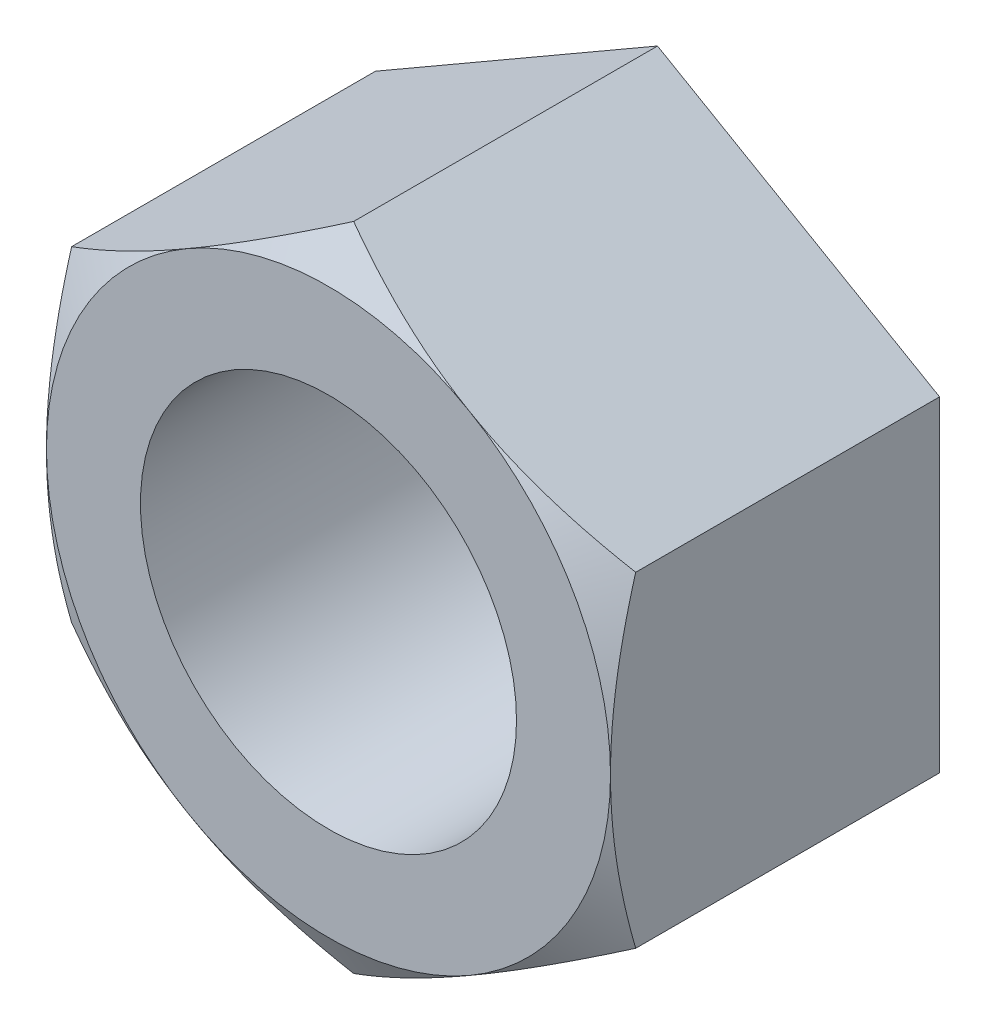
ISO-10303-21;
HEADER;
FILE_DESCRIPTION(('STEP AP214'),'2;1');
FILE_NAME('part.step','',(''),(''),'','','');
FILE_SCHEMA(('AUTOMOTIVE_DESIGN { 1 0 10303 214 1 1 1 1 }'));
ENDSEC;
DATA;
#1=APPLICATION_CONTEXT('core data for automotive mechanical design processes');
#2=APPLICATION_PROTOCOL_DEFINITION('international standard','automotive_design',2000,#1);
#3=PRODUCT_CONTEXT('',#1,'mechanical');
#4=PRODUCT('Part','Part','',(#3));
#5=PRODUCT_RELATED_PRODUCT_CATEGORY('part','',(#4));
#6=PRODUCT_DEFINITION_FORMATION('','',#4);
#7=PRODUCT_DEFINITION_CONTEXT('part definition',#1,'design');
#8=PRODUCT_DEFINITION('design','',#6,#7);
#9=PRODUCT_DEFINITION_SHAPE('','',#8);
#10=(LENGTH_UNIT() NAMED_UNIT(*) SI_UNIT(.MILLI.,.METRE.));
#11=(NAMED_UNIT(*) PLANE_ANGLE_UNIT() SI_UNIT($,.RADIAN.));
#12=(NAMED_UNIT(*) SI_UNIT($,.STERADIAN.) SOLID_ANGLE_UNIT());
#13=UNCERTAINTY_MEASURE_WITH_UNIT(LENGTH_MEASURE(1.E-05),#10,'distance_accuracy_value','');
#14=(GEOMETRIC_REPRESENTATION_CONTEXT(3) GLOBAL_UNCERTAINTY_ASSIGNED_CONTEXT((#13)) GLOBAL_UNIT_ASSIGNED_CONTEXT((#10,
#11,#12)) REPRESENTATION_CONTEXT('',''));
#15=CARTESIAN_POINT('',(0.,0.,0.));
#16=DIRECTION('',(0.,0.,1.));
#17=DIRECTION('',(1.,0.,0.));
#18=AXIS2_PLACEMENT_3D('',#15,#16,#17);
#19=CARTESIAN_POINT('',(-11.90625,6.87407664253898,6.9453125));
#20=DIRECTION('',(0.,0.,1.));
#21=DIRECTION('',(1.,0.,0.));
#22=AXIS2_PLACEMENT_3D('',#19,#20,#21);
#23=PLANE('',#22);
#24=CARTESIAN_POINT('',(0.,0.,6.9453125));
#25=DIRECTION('',(0.,0.,1.));
#26=DIRECTION('',(1.,0.,0.));
#27=AXIS2_PLACEMENT_3D('',#24,#25,#26);
#28=CIRCLE('',#27,7.9375);
#29=CARTESIAN_POINT('',(7.9375,0.,6.9453125));
#30=VERTEX_POINT('',#29);
#31=EDGE_CURVE('E258',#30,#30,#28,.T.);
#32=ORIENTED_EDGE('',*,*,#31,.F.);
#33=EDGE_LOOP('',(#32));
#34=FACE_BOUND('',#33,.T.);
#35=CARTESIAN_POINT('',(0.,0.,6.9453125));
#36=DIRECTION('',(0.,0.,1.));
#37=DIRECTION('',(1.,0.,0.));
#38=AXIS2_PLACEMENT_3D('',#35,#36,#37);
#39=CIRCLE('',#38,11.90625);
#40=CARTESIAN_POINT('',(5.95312500000001,-10.3111149638085,6.9453125));
#41=VERTEX_POINT('',#40);
#42=CARTESIAN_POINT('',(11.90625,0.,6.9453125));
#43=VERTEX_POINT('',#42);
#44=EDGE_CURVE('E146',#41,#43,#39,.T.);
#45=ORIENTED_EDGE('',*,*,#44,.T.);
#46=CARTESIAN_POINT('',(5.953125,10.3111149638085,6.9453125));
#47=VERTEX_POINT('',#46);
#48=EDGE_CURVE('E144',#43,#47,#39,.T.);
#49=ORIENTED_EDGE('',*,*,#48,.T.);
#50=CARTESIAN_POINT('',(-5.95312500000001,10.3111149638085,6.9453125));
#51=VERTEX_POINT('',#50);
#52=EDGE_CURVE('E126',#47,#51,#39,.T.);
#53=ORIENTED_EDGE('',*,*,#52,.T.);
#54=CARTESIAN_POINT('',(-11.90625,0.,6.9453125));
#55=VERTEX_POINT('',#54);
#56=EDGE_CURVE('E116',#51,#55,#39,.T.);
#57=ORIENTED_EDGE('',*,*,#56,.T.);
#58=CARTESIAN_POINT('',(-5.953125,-10.3111149638085,6.9453125));
#59=VERTEX_POINT('',#58);
#60=EDGE_CURVE('E61',#55,#59,#39,.T.);
#61=ORIENTED_EDGE('',*,*,#60,.T.);
#62=EDGE_CURVE('E69',#59,#41,#39,.T.);
#63=ORIENTED_EDGE('',*,*,#62,.T.);
#64=EDGE_LOOP('',(#45,#49,#53,#57,#61,#63));
#65=FACE_BOUND('',#64,.T.);
#66=ADVANCED_FACE('F39',(#34,#65),#23,.T.);
#67=CARTESIAN_POINT('',(0.,13.748153285078,6.9453125));
#68=DIRECTION('',(0.5,-0.866025403784438,0.));
#69=DIRECTION('',(0.866025403784438,0.5,0.));
#70=AXIS2_PLACEMENT_3D('',#67,#68,#69);
#71=PLANE('',#70);
#72=CARTESIAN_POINT('',(0.000199999999996673,13.7482687551318,5.88182247503243));
#73=CARTESIAN_POINT('',(-0.261524981873897,13.5971617663933,5.9690494750194));
#74=CARTESIAN_POINT('',(-0.524225808890103,13.4454913731991,6.05231747832444));
#75=CARTESIAN_POINT('',(-1.05173412418134,13.140934305366,6.20983699133583));
#76=CARTESIAN_POINT('',(-1.31654227499472,12.9880472482102,6.28408553553748));
#77=CARTESIAN_POINT('',(-2.11523355829519,12.5269226207973,6.49186507126941));
#78=CARTESIAN_POINT('',(-2.65226962507615,12.2168647030768,6.61004884279191));
#79=CARTESIAN_POINT('',(-3.4559194731091,11.7528772469808,6.74862990247941));
#80=CARTESIAN_POINT('',(-3.72013234184621,11.600333876092,6.78810635226597));
#81=CARTESIAN_POINT('',(-4.24978140322914,11.2945408479266,6.85430557416854));
#82=CARTESIAN_POINT('',(-4.51521761932178,11.1412911771128,6.88102810080637));
#83=CARTESIAN_POINT('',(-5.04653258377681,10.8345363393602,6.92103499348141));
#84=CARTESIAN_POINT('',(-5.31241042840957,10.6810316941899,6.93433532842185));
#85=CARTESIAN_POINT('',(-5.84441247743875,10.3738801679735,6.94721442187782));
#86=CARTESIAN_POINT('',(-6.11053667396914,10.2202332914688,6.94679360435825));
#87=CARTESIAN_POINT('',(-6.60805632941785,9.93299018446836,6.93318799784219));
#88=CARTESIAN_POINT('',(-6.83948726971147,9.79937346879103,6.92166279403806));
#89=CARTESIAN_POINT('',(-7.30181686119411,9.5324473546942,6.8884522768541));
#90=CARTESIAN_POINT('',(-7.5327154735703,9.39913797868329,6.86676624479557));
#91=CARTESIAN_POINT('',(-7.99385492656356,9.13289899136368,6.8136121488488));
#92=CARTESIAN_POINT('',(-8.22409506479845,8.99996978557551,6.78213600549017));
#93=CARTESIAN_POINT('',(-8.68349592191088,8.7347345770557,6.70995395335846));
#94=CARTESIAN_POINT('',(-8.91265656633912,8.60242861730739,6.66924741723853));
#95=CARTESIAN_POINT('',(-9.60828656873104,8.20080644817003,6.53225319705611));
#96=CARTESIAN_POINT('',(-10.0727414696073,7.93265328612266,6.42230562071017));
#97=CARTESIAN_POINT('',(-10.9947255825326,7.40034551033668,6.17276942686946));
#98=CARTESIAN_POINT('',(-11.4522665995603,7.13618408099047,6.03323941585841));
#99=CARTESIAN_POINT('',(-11.90645,6.87396117248514,5.88182247503243));
#100=B_SPLINE_CURVE_WITH_KNOTS('',3,(#72,#73,#74,#75,#76,#77,#78,#79,#80,#81,#82,#83,#84,#85,
#86,#87,#88,#89,#90,#91,#92,#93,#94,#95,#96,#97,#98,#99),.UNSPECIFIED.,.F.,.F.,(4,2,2,2,2,2,2,2,
2,2,2,2,2,4),(0.,0.943575208414198,1.88745981967605,3.77924706309544,4.70192280857966,
5.62461631233488,6.54621075295352,7.4677767175883,8.27002897862037,9.07233799178402,
9.87531089002933,10.678338378973,12.3197076467667,13.9578550457927),.UNSPECIFIED.);
#101=CARTESIAN_POINT('',(0.,13.748153285078,5.88188914253899));
#102=VERTEX_POINT('',#101);
#103=EDGE_CURVE('E131',#102,#51,#100,.T.);
#104=ORIENTED_EDGE('',*,*,#103,.F.);
#105=DIRECTION('',(0.,0.,-1.));
#106=VECTOR('',#105,1.);
#107=CARTESIAN_POINT('',(0.,13.748153285078,6.9453125));
#108=LINE('',#107,#106);
#109=CARTESIAN_POINT('',(0.,13.748153285078,-6.9453125));
#110=VERTEX_POINT('',#109);
#111=EDGE_CURVE('E236',#102,#110,#108,.T.);
#112=ORIENTED_EDGE('',*,*,#111,.T.);
#113=DIRECTION('',(-0.866025403784438,-0.5,0.));
#114=VECTOR('',#113,1.);
#115=CARTESIAN_POINT('',(0.,13.748153285078,-6.9453125));
#116=LINE('',#115,#114);
#117=CARTESIAN_POINT('',(-11.90625,6.87407664253898,-6.9453125));
#118=VERTEX_POINT('',#117);
#119=EDGE_CURVE('E253',#110,#118,#116,.T.);
#120=ORIENTED_EDGE('',*,*,#119,.T.);
#121=DIRECTION('',(0.,0.,-1.));
#122=VECTOR('',#121,1.);
#123=CARTESIAN_POINT('',(-11.90625,6.87407664253898,6.9453125));
#124=LINE('',#123,#122);
#125=CARTESIAN_POINT('',(-11.90625,6.87407664253898,5.88188914253899));
#126=VERTEX_POINT('',#125);
#127=EDGE_CURVE('E140',#126,#118,#124,.T.);
#128=ORIENTED_EDGE('',*,*,#127,.F.);
#129=EDGE_CURVE('E120',#51,#126,#100,.T.);
#130=ORIENTED_EDGE('',*,*,#129,.F.);
#131=EDGE_LOOP('',(#104,#112,#120,#128,#130));
#132=FACE_BOUND('',#131,.T.);
#133=ADVANCED_FACE('F41',(#132),#71,.F.);
#134=CARTESIAN_POINT('',(-11.90625,6.87407664253898,6.9453125));
#135=DIRECTION('',(1.,0.,0.));
#136=DIRECTION('',(0.,0.,-1.));
#137=AXIS2_PLACEMENT_3D('',#134,#135,#136);
#138=PLANE('',#137);
#139=CARTESIAN_POINT('',(-11.90625,-18.5673552140383,1.0848499059225));
#140=CARTESIAN_POINT('',(-11.90625,-18.3068307746585,1.21146500833765));
#141=CARTESIAN_POINT('',(-11.90625,-18.0460032867526,1.33745626145253));
#142=CARTESIAN_POINT('',(-11.90625,-17.5236789841053,1.58804992744852));
#143=CARTESIAN_POINT('',(-11.90625,-17.2621821628058,1.71265232665691));
#144=CARTESIAN_POINT('',(-11.90625,-16.4765245072167,2.08419676725728));
#145=CARTESIAN_POINT('',(-11.90625,-15.9512720994162,2.32883920122821));
#146=CARTESIAN_POINT('',(-11.90625,-14.8944773157735,2.81182501553762));
#147=CARTESIAN_POINT('',(-11.90625,-14.3629163283528,3.05012776920683));
#148=CARTESIAN_POINT('',(-11.90625,-13.2956008327318,3.51711578462236));
#149=CARTESIAN_POINT('',(-11.90625,-12.7598465214916,3.74580149490336));
#150=CARTESIAN_POINT('',(-11.90625,-11.6659671635015,4.19817733367513));
#151=CARTESIAN_POINT('',(-11.90625,-11.107676921657,4.42147006170378));
#152=CARTESIAN_POINT('',(-11.90625,-9.98460011137813,4.85140406493413));
#153=CARTESIAN_POINT('',(-11.90625,-9.41981282816215,5.05804348758468));
#154=CARTESIAN_POINT('',(-11.90625,-8.28388397382646,5.44932080582238));
#155=CARTESIAN_POINT('',(-11.90625,-7.71275752970014,5.6340022689018));
#156=CARTESIAN_POINT('',(-11.90625,-6.56226117213405,5.97551823534148));
#157=CARTESIAN_POINT('',(-11.90625,-5.98289388134208,6.13236139314053));
#158=CARTESIAN_POINT('',(-11.90625,-5.10906842552033,6.34071798005094));
#159=CARTESIAN_POINT('',(-11.90625,-4.81776750031095,6.4055504058056));
#160=CARTESIAN_POINT('',(-11.90625,-4.2331562985892,6.52547053987966));
#161=CARTESIAN_POINT('',(-11.90625,-3.93984606248573,6.58055844357541));
#162=CARTESIAN_POINT('',(-11.90625,-3.3514132971481,6.68002316314585));
#163=CARTESIAN_POINT('',(-11.90625,-3.05629081274275,6.72440024288388));
#164=CARTESIAN_POINT('',(-11.90625,-2.46453553538261,6.80156259175516));
#165=CARTESIAN_POINT('',(-11.90625,-2.16790280257392,6.83434831891049));
#166=CARTESIAN_POINT('',(-11.90625,-1.57745999454359,6.88725971623624));
#167=CARTESIAN_POINT('',(-11.90625,-1.28366450653079,6.9075471649675));
#168=CARTESIAN_POINT('',(-11.90625,-0.695479166982555,6.93567427584419));
#169=CARTESIAN_POINT('',(-11.90625,-0.401089325566568,6.94351414816167));
#170=CARTESIAN_POINT('',(-11.90625,0.187763905127909,6.94655917989799));
#171=CARTESIAN_POINT('',(-11.90625,0.482227295757805,6.94176408698706));
#172=CARTESIAN_POINT('',(-11.90625,1.07068710491147,6.91965717795243));
#173=CARTESIAN_POINT('',(-11.90625,1.36468350063162,6.90234476835585));
#174=CARTESIAN_POINT('',(-11.90625,2.06786452772189,6.8463361942515));
#175=CARTESIAN_POINT('',(-11.90625,2.47660106515668,6.80188958424609));
#176=CARTESIAN_POINT('',(-11.90625,3.29109084588527,6.69120118159998));
#177=CARTESIAN_POINT('',(-11.90625,3.69684369123491,6.62495653371929));
#178=CARTESIAN_POINT('',(-11.90625,4.90910670477736,6.39703520037114));
#179=CARTESIAN_POINT('',(-11.90625,5.71021142633358,6.20620813755511));
#180=CARTESIAN_POINT('',(-11.90625,6.90879245934975,5.87451295587347));
#181=CARTESIAN_POINT('',(-11.90625,7.31245543531222,5.75471125222669));
#182=CARTESIAN_POINT('',(-11.90625,8.11585883891396,5.50249163454229));
#183=CARTESIAN_POINT('',(-11.90625,8.51559923517273,5.37007361966528));
#184=CARTESIAN_POINT('',(-11.90625,9.31129265551663,5.09475898454332));
#185=CARTESIAN_POINT('',(-11.90625,9.70724675698889,4.95186545185313));
#186=CARTESIAN_POINT('',(-11.90625,10.2987013060532,4.7309443296447));
#187=CARTESIAN_POINT('',(-11.90625,10.4954385264206,4.65620776188112));
#188=CARTESIAN_POINT('',(-11.90625,10.8881377122624,4.50472352554935));
#189=CARTESIAN_POINT('',(-11.90625,11.0840996759058,4.42797585223487));
#190=CARTESIAN_POINT('',(-11.90625,11.6435551517819,4.20583410768122));
#191=CARTESIAN_POINT('',(-11.90625,12.0061530406351,4.05818139714602));
#192=CARTESIAN_POINT('',(-11.90625,12.7291067773838,3.75747709880905));
#193=CARTESIAN_POINT('',(-11.90625,13.0894625603421,3.6044253554858));
#194=CARTESIAN_POINT('',(-11.90625,14.1676252074473,3.13836888672697));
#195=CARTESIAN_POINT('',(-11.90625,14.8824619713932,2.81848923449913));
#196=CARTESIAN_POINT('',(-11.90625,16.3062286636984,2.1651234863937));
#197=CARTESIAN_POINT('',(-11.90625,17.0151558264589,1.83163140815274));
#198=CARTESIAN_POINT('',(-11.90625,18.4280925013598,1.15449990432105));
#199=CARTESIAN_POINT('',(-11.90625,19.1321022568636,0.810860985362749));
#200=CARTESIAN_POINT('',(-11.90625,20.5374889504988,0.115176126757464));
#201=CARTESIAN_POINT('',(-11.90625,21.2388590713526,-0.236883548702462));
#202=CARTESIAN_POINT('',(-11.90625,22.638500659687,-0.947117659866747));
#203=CARTESIAN_POINT('',(-11.90625,23.3367720949425,-1.30529215897618));
#204=CARTESIAN_POINT('',(-11.90625,24.7306268501637,-2.02639934851386));
#205=CARTESIAN_POINT('',(-11.90625,25.426210804989,-2.38933081333154));
#206=CARTESIAN_POINT('',(-11.90625,26.8153202192537,-3.11910154343936));
#207=CARTESIAN_POINT('',(-11.90625,27.5088456865724,-3.48594079374688));
#208=CARTESIAN_POINT('',(-11.90625,29.4270178592802,-4.5061847344604));
#209=CARTESIAN_POINT('',(-11.90625,30.6498666844115,-5.16296876501287));
#210=CARTESIAN_POINT('',(-11.90625,33.0918038761063,-6.48368588285549));
#211=CARTESIAN_POINT('',(-11.90625,34.3108919634541,-7.14761948527726));
#212=CARTESIAN_POINT('',(-11.90625,36.7418813680407,-8.47841376718874));
#213=CARTESIAN_POINT('',(-11.90625,37.9537928669588,-9.14525585869681));
#214=CARTESIAN_POINT('',(-11.90625,39.769951103279,-10.1484852101966));
#215=CARTESIAN_POINT('',(-11.90625,40.3750261560823,-10.4833747826276));
#216=CARTESIAN_POINT('',(-11.90625,41.5846846791414,-11.1540391432842));
#217=CARTESIAN_POINT('',(-11.90625,42.1892681499144,-11.489813930577));
#218=CARTESIAN_POINT('',(-11.90625,42.7936367169954,-11.8259751723404));
#219=B_SPLINE_CURVE_WITH_KNOTS('',3,(#139,#140,#141,#142,#143,#144,#145,#146,#147,#148,#149,
#150,#151,#152,#153,#154,#155,#156,#157,#158,#159,#160,#161,#162,#163,#164,#165,#166,#167,#168,
#169,#170,#171,#172,#173,#174,#175,#176,#177,#178,#179,#180,#181,#182,#183,#184,#185,#186,#187,
#188,#189,#190,#191,#192,#193,#194,#195,#196,#197,#198,#199,#200,#201,#202,#203,#204,#205,#206,
#207,#208,#209,#210,#211,#212,#213,#214,#215,#216,#217,#218),.UNSPECIFIED.,.F.,.F.,(4,2,2,2,2,2,
2,2,2,2,2,2,2,2,2,2,2,2,2,2,2,2,2,2,2,2,2,2,2,2,2,2,2,2,2,2,2,2,2,4),(0.,0.868985976470645,
1.7379805002277,3.47622189175011,5.2237481442826,6.97119280235903,8.77485485801763,
10.5787172809377,12.3789386646861,14.1785994072986,15.0737478036215,15.9688782503063,
16.8639866430176,17.759059662354,18.6422889993771,19.5255034232882,20.4087354857896,
21.292009426967,22.5247540146433,23.7576601390455,26.2247016092919,27.4877895567343,
28.7508876006073,30.0136148441653,30.6449685916826,31.2763238293509,32.4507908484182,
33.6252917261889,35.9745048914631,38.3247618413294,40.6749016404872,43.0291789632396,
45.383480712517,47.7371873659786,50.0908849984785,54.2550427492556,58.4195025651345,
62.5692715807648,64.6439762355497,66.7186787048788),.UNSPECIFIED.);
#220=EDGE_CURVE('E122',#126,#55,#219,.F.);
#221=ORIENTED_EDGE('',*,*,#220,.F.);
#222=ORIENTED_EDGE('',*,*,#127,.T.);
#223=DIRECTION('',(0.,-1.,0.));
#224=VECTOR('',#223,1.);
#225=CARTESIAN_POINT('',(-11.90625,6.87407664253898,-6.9453125));
#226=LINE('',#225,#224);
#227=CARTESIAN_POINT('',(-11.90625,-6.87407664253899,-6.9453125));
#228=VERTEX_POINT('',#227);
#229=EDGE_CURVE('E249',#118,#228,#226,.T.);
#230=ORIENTED_EDGE('',*,*,#229,.T.);
#231=DIRECTION('',(0.,0.,-1.));
#232=VECTOR('',#231,1.);
#233=CARTESIAN_POINT('',(-11.90625,-6.87407664253899,6.9453125));
#234=LINE('',#233,#232);
#235=CARTESIAN_POINT('',(-11.90625,-6.87407664253899,5.88188914253899));
#236=VERTEX_POINT('',#235);
#237=EDGE_CURVE('E245',#236,#228,#234,.T.);
#238=ORIENTED_EDGE('',*,*,#237,.F.);
#239=EDGE_CURVE('E189',#55,#236,#219,.F.);
#240=ORIENTED_EDGE('',*,*,#239,.F.);
#241=EDGE_LOOP('',(#221,#222,#230,#238,#240));
#242=FACE_BOUND('',#241,.T.);
#243=ADVANCED_FACE('F198',(#242),#138,.F.);
#244=CARTESIAN_POINT('',(-11.90625,-6.87407664253899,6.9453125));
#245=DIRECTION('',(0.5,0.866025403784439,0.));
#246=DIRECTION('',(-0.866025403784439,0.5,0.));
#247=AXIS2_PLACEMENT_3D('',#244,#245,#246);
#248=PLANE('',#247);
#249=CARTESIAN_POINT('',(-11.90645,-6.87396117248515,5.88182247503243));
#250=CARTESIAN_POINT('',(-11.6447250181261,-7.02506816122369,5.9690494750194));
#251=CARTESIAN_POINT('',(-11.3820241911099,-7.17673855441783,6.05231747832444));
#252=CARTESIAN_POINT('',(-10.8545158758187,-7.48129562225099,6.20983699133583));
#253=CARTESIAN_POINT('',(-10.5897077250053,-7.63418267940671,6.28408553553748));
#254=CARTESIAN_POINT('',(-9.79101644170481,-8.09530730681964,6.49186507126941));
#255=CARTESIAN_POINT('',(-9.25398037492385,-8.40536522454017,6.61004884279192));
#256=CARTESIAN_POINT('',(-8.45033052689091,-8.86935268063619,6.74862990247941));
#257=CARTESIAN_POINT('',(-8.18611765815379,-9.02189605152493,6.78810635226597));
#258=CARTESIAN_POINT('',(-7.65646859677086,-9.32768907969039,6.85430557416854));
#259=CARTESIAN_POINT('',(-7.39103238067822,-9.48093875050415,6.88102810080637));
#260=CARTESIAN_POINT('',(-6.8597174162232,-9.78769358825674,6.92103499348141));
#261=CARTESIAN_POINT('',(-6.59383957159043,-9.94119823342702,6.93433532842185));
#262=CARTESIAN_POINT('',(-6.06183752256125,-10.2483497596435,6.94721442187782));
#263=CARTESIAN_POINT('',(-5.79571332603086,-10.4019966361481,6.94679360435825));
#264=CARTESIAN_POINT('',(-5.29819367058215,-10.6892397431486,6.93318799784219));
#265=CARTESIAN_POINT('',(-5.06676273028853,-10.8228564588259,6.92166279403806));
#266=CARTESIAN_POINT('',(-4.60443313880589,-11.0897825729228,6.8884522768541));
#267=CARTESIAN_POINT('',(-4.3735345264297,-11.2230919489337,6.86676624479557));
#268=CARTESIAN_POINT('',(-3.91239507343643,-11.4893309362533,6.8136121488488));
#269=CARTESIAN_POINT('',(-3.68215493520155,-11.6222601420414,6.78213600549017));
#270=CARTESIAN_POINT('',(-3.22275407808912,-11.8874953505612,6.70995395335846));
#271=CARTESIAN_POINT('',(-2.99359343366088,-12.0198013103096,6.66924741723853));
#272=CARTESIAN_POINT('',(-2.29796343126896,-12.4214234794469,6.53225319705611));
#273=CARTESIAN_POINT('',(-1.83350853039266,-12.6895766414943,6.42230562071017));
#274=CARTESIAN_POINT('',(-0.911524417467354,-13.2218844172803,6.17276942686945));
#275=CARTESIAN_POINT('',(-0.453983400439705,-13.4860458466265,6.0332394158584));
#276=CARTESIAN_POINT('',(0.000200000000004019,-13.7482687551318,5.88182247503243));
#277=B_SPLINE_CURVE_WITH_KNOTS('',3,(#249,#250,#251,#252,#253,#254,#255,#256,#257,#258,#259,
#260,#261,#262,#263,#264,#265,#266,#267,#268,#269,#270,#271,#272,#273,#274,#275,#276),
.UNSPECIFIED.,.F.,.F.,(4,2,2,2,2,2,2,2,2,2,2,2,2,4),(0.,0.943575208414198,1.88745981967605,
3.77924706309544,4.70192280857966,5.62461631233488,6.54621075295352,7.46777671758831,
8.27002897862037,9.07233799178402,9.87531089002933,10.678338378973,12.3197076467667,
13.9578550457927),.UNSPECIFIED.);
#278=EDGE_CURVE('E187',#236,#59,#277,.T.);
#279=ORIENTED_EDGE('',*,*,#278,.F.);
#280=ORIENTED_EDGE('',*,*,#237,.T.);
#281=DIRECTION('',(0.866025403784439,-0.5,0.));
#282=VECTOR('',#281,1.);
#283=CARTESIAN_POINT('',(-11.90625,-6.87407664253899,-6.9453125));
#284=LINE('',#283,#282);
#285=CARTESIAN_POINT('',(0.,-13.748153285078,-6.9453125));
#286=VERTEX_POINT('',#285);
#287=EDGE_CURVE('E256',#228,#286,#284,.T.);
#288=ORIENTED_EDGE('',*,*,#287,.T.);
#289=DIRECTION('',(0.,0.,-1.));
#290=VECTOR('',#289,1.);
#291=CARTESIAN_POINT('',(0.,-13.748153285078,6.9453125));
#292=LINE('',#291,#290);
#293=CARTESIAN_POINT('',(0.,-13.748153285078,5.88188914253899));
#294=VERTEX_POINT('',#293);
#295=EDGE_CURVE('E238',#294,#286,#292,.T.);
#296=ORIENTED_EDGE('',*,*,#295,.F.);
#297=EDGE_CURVE('E181',#59,#294,#277,.T.);
#298=ORIENTED_EDGE('',*,*,#297,.F.);
#299=EDGE_LOOP('',(#279,#280,#288,#296,#298));
#300=FACE_BOUND('',#299,.T.);
#301=ADVANCED_FACE('F194',(#300),#248,.F.);
#302=CARTESIAN_POINT('',(0.,-13.748153285078,6.9453125));
#303=DIRECTION('',(-0.5,0.866025403784438,0.));
#304=DIRECTION('',(-0.866025403784438,-0.5,0.));
#305=AXIS2_PLACEMENT_3D('',#302,#303,#304);
#306=PLANE('',#305);
#307=CARTESIAN_POINT('',(-0.000199999999995806,-13.7482687551318,5.88182247503243));
#308=CARTESIAN_POINT('',(0.261524981873898,-13.5971617663933,5.9690494750194));
#309=CARTESIAN_POINT('',(0.524225808890104,-13.4454913731991,6.05231747832444));
#310=CARTESIAN_POINT('',(1.05173412418134,-13.140934305366,6.20983699133583));
#311=CARTESIAN_POINT('',(1.31654227499472,-12.9880472482102,6.28408553553748));
#312=CARTESIAN_POINT('',(2.11523355829519,-12.5269226207973,6.49186507126941));
#313=CARTESIAN_POINT('',(2.65226962507615,-12.2168647030768,6.61004884279192));
#314=CARTESIAN_POINT('',(3.4559194731091,-11.7528772469808,6.74862990247941));
#315=CARTESIAN_POINT('',(3.72013234184621,-11.600333876092,6.78810635226597));
#316=CARTESIAN_POINT('',(4.24978140322914,-11.2945408479266,6.85430557416854));
#317=CARTESIAN_POINT('',(4.51521761932178,-11.1412911771128,6.88102810080637));
#318=CARTESIAN_POINT('',(5.04653258377681,-10.8345363393602,6.92103499348141));
#319=CARTESIAN_POINT('',(5.31241042840957,-10.6810316941899,6.93433532842185));
#320=CARTESIAN_POINT('',(5.84441247743875,-10.3738801679735,6.94721442187782));
#321=CARTESIAN_POINT('',(6.11053667396914,-10.2202332914688,6.94679360435825));
#322=CARTESIAN_POINT('',(6.60805632941785,-9.93299018446836,6.93318799784219));
#323=CARTESIAN_POINT('',(6.83948726971148,-9.79937346879103,6.92166279403806));
#324=CARTESIAN_POINT('',(7.30181686119411,-9.5324473546942,6.8884522768541));
#325=CARTESIAN_POINT('',(7.5327154735703,-9.39913797868329,6.86676624479557));
#326=CARTESIAN_POINT('',(7.99385492656357,-9.13289899136367,6.8136121488488));
#327=CARTESIAN_POINT('',(8.22409506479845,-8.99996978557551,6.78213600549017));
#328=CARTESIAN_POINT('',(8.68349592191088,-8.7347345770557,6.70995395335846));
#329=CARTESIAN_POINT('',(8.91265656633913,-8.60242861730739,6.66924741723853));
#330=CARTESIAN_POINT('',(9.60828656873104,-8.20080644817003,6.53225319705611));
#331=CARTESIAN_POINT('',(10.0727414696073,-7.93265328612266,6.42230562071017));
#332=CARTESIAN_POINT('',(10.9947255825326,-7.40034551033668,6.17276942686945));
#333=CARTESIAN_POINT('',(11.4522665995603,-7.13618408099047,6.0332394158584));
#334=CARTESIAN_POINT('',(11.90645,-6.87396117248514,5.88182247503243));
#335=B_SPLINE_CURVE_WITH_KNOTS('',3,(#307,#308,#309,#310,#311,#312,#313,#314,#315,#316,#317,
#318,#319,#320,#321,#322,#323,#324,#325,#326,#327,#328,#329,#330,#331,#332,#333,#334),
.UNSPECIFIED.,.F.,.F.,(4,2,2,2,2,2,2,2,2,2,2,2,2,4),(0.,0.943575208414198,1.88745981967605,
3.77924706309544,4.70192280857966,5.62461631233488,6.54621075295352,7.4677767175883,
8.27002897862037,9.07233799178402,9.87531089002933,10.678338378973,12.3197076467667,
13.9578550457927),.UNSPECIFIED.);
#336=EDGE_CURVE('E188',#294,#41,#335,.T.);
#337=ORIENTED_EDGE('',*,*,#336,.F.);
#338=ORIENTED_EDGE('',*,*,#295,.T.);
#339=DIRECTION('',(0.866025403784438,0.5,0.));
#340=VECTOR('',#339,1.);
#341=CARTESIAN_POINT('',(0.,-13.748153285078,-6.9453125));
#342=LINE('',#341,#340);
#343=CARTESIAN_POINT('',(11.90625,-6.87407664253898,-6.9453125));
#344=VERTEX_POINT('',#343);
#345=EDGE_CURVE('E264',#286,#344,#342,.T.);
#346=ORIENTED_EDGE('',*,*,#345,.T.);
#347=DIRECTION('',(0.,0.,-1.));
#348=VECTOR('',#347,1.);
#349=CARTESIAN_POINT('',(11.90625,-6.87407664253898,6.9453125));
#350=LINE('',#349,#348);
#351=CARTESIAN_POINT('',(11.90625,-6.87407664253898,5.88188914253899));
#352=VERTEX_POINT('',#351);
#353=EDGE_CURVE('E235',#352,#344,#350,.T.);
#354=ORIENTED_EDGE('',*,*,#353,.F.);
#355=EDGE_CURVE('E155',#41,#352,#335,.T.);
#356=ORIENTED_EDGE('',*,*,#355,.F.);
#357=EDGE_LOOP('',(#337,#338,#346,#354,#356));
#358=FACE_BOUND('',#357,.T.);
#359=ADVANCED_FACE('F197',(#358),#306,.F.);
#360=CARTESIAN_POINT('',(11.90625,-6.87407664253898,6.9453125));
#361=DIRECTION('',(-1.,0.,0.));
#362=DIRECTION('',(0.,-1.,0.));
#363=AXIS2_PLACEMENT_3D('',#360,#361,#362);
#364=PLANE('',#363);
#365=CARTESIAN_POINT('',(11.90625,-18.5673552158542,1.08484990503998));
#366=CARTESIAN_POINT('',(11.90625,-18.3068307764438,1.21146500747359));
#367=CARTESIAN_POINT('',(11.90625,-18.0460032885073,1.33745626060693));
#368=CARTESIAN_POINT('',(11.90625,-17.5236789857989,1.58804992663979));
#369=CARTESIAN_POINT('',(11.90625,-17.2621821644687,1.7126523258666));
#370=CARTESIAN_POINT('',(11.90625,-16.4765245087877,2.08419676652218));
#371=CARTESIAN_POINT('',(11.90625,-15.9512721009259,2.32883920052983));
#372=CARTESIAN_POINT('',(11.90625,-14.8944773171595,2.81182501491269));
#373=CARTESIAN_POINT('',(11.90625,-14.3629163296764,3.05012776861864));
#374=CARTESIAN_POINT('',(11.90625,-13.2956008339303,3.51711578410702));
#375=CARTESIAN_POINT('',(11.90625,-12.7598465226274,3.74580149442414));
#376=CARTESIAN_POINT('',(11.90625,-11.6659671645072,4.19817733326904));
#377=CARTESIAN_POINT('',(11.90625,-11.1076769225954,4.42147006133463));
#378=CARTESIAN_POINT('',(11.90625,-9.98460011218061,4.85140406463687));
#379=CARTESIAN_POINT('',(11.90625,-9.41981282889614,5.05804348732238));
#380=CARTESIAN_POINT('',(11.90625,-8.28388397442225,5.44932080562662));
#381=CARTESIAN_POINT('',(11.90625,-7.71275753022618,5.63400226873763));
#382=CARTESIAN_POINT('',(11.90625,-6.5622611725187,5.97551823523531));
#383=CARTESIAN_POINT('',(11.90625,-5.98289388165505,6.13236139306077));
#384=CARTESIAN_POINT('',(11.90625,-5.10906842570671,6.34071798000905));
#385=CARTESIAN_POINT('',(11.90625,-4.81776750044311,6.40555040577759));
#386=CARTESIAN_POINT('',(11.90625,-4.23315629861213,6.52547053987585));
#387=CARTESIAN_POINT('',(11.90625,-3.93984606245367,6.58055844358192));
#388=CARTESIAN_POINT('',(11.90625,-3.35141329700545,6.68002316316887));
#389=CARTESIAN_POINT('',(11.90625,-3.0562908125445,6.7244002429131));
#390=CARTESIAN_POINT('',(11.90625,-2.46453553507271,6.8015625917922));
#391=CARTESIAN_POINT('',(11.90625,-2.16790280220795,6.83434831894915));
#392=CARTESIAN_POINT('',(11.90625,-1.57745999406665,6.88725971627319));
#393=CARTESIAN_POINT('',(11.90625,-1.28366450599894,6.90754716500121));
#394=CARTESIAN_POINT('',(11.90625,-0.695479166340997,6.93567427586659));
#395=CARTESIAN_POINT('',(11.90625,-0.401089324870217,6.94351414817599));
#396=CARTESIAN_POINT('',(11.90625,0.187763905933431,6.94655917989144));
#397=CARTESIAN_POINT('',(11.90625,0.482227296617703,6.94176408696771));
#398=CARTESIAN_POINT('',(11.90625,1.07068710587941,6.91965717790311));
#399=CARTESIAN_POINT('',(11.90625,1.36468350165322,6.90234476828935));
#400=CARTESIAN_POINT('',(11.90625,2.0678645288268,6.84633619414277));
#401=CARTESIAN_POINT('',(11.90625,2.47660106629098,6.80188958411302));
#402=CARTESIAN_POINT('',(11.90625,3.29109084707704,6.69120118141691));
#403=CARTESIAN_POINT('',(11.90625,3.69684369245477,6.62495653351058));
#404=CARTESIAN_POINT('',(11.90625,4.90910670607995,6.39703520008494));
#405=CARTESIAN_POINT('',(11.90625,5.7102114276892,6.20620813721655));
#406=CARTESIAN_POINT('',(11.90625,6.90879246078474,5.8745129554576));
#407=CARTESIAN_POINT('',(11.90625,7.31245543677425,5.75471125178485));
#408=CARTESIAN_POINT('',(11.90625,8.11585884042976,5.50249163404928));
#409=CARTESIAN_POINT('',(11.90625,8.51559923671527,5.37007361914708));
#410=CARTESIAN_POINT('',(11.90625,9.31129265711245,5.09475898397562));
#411=CARTESIAN_POINT('',(11.90625,9.70724675861125,4.95186545126112));
#412=CARTESIAN_POINT('',(11.90625,10.2987013077153,4.73094432901686));
#413=CARTESIAN_POINT('',(11.90625,10.4954385280961,4.65620776124143));
#414=CARTESIAN_POINT('',(11.90625,10.8881377139644,4.50472352488617));
#415=CARTESIAN_POINT('',(11.90625,11.0840996776211,4.42797585156005));
#416=CARTESIAN_POINT('',(11.90625,11.6435551535041,4.20583410698573));
#417=CARTESIAN_POINT('',(11.90625,12.0061530423511,4.05818139644229));
#418=CARTESIAN_POINT('',(11.90625,12.7291067790878,3.75747709809029));
#419=CARTESIAN_POINT('',(11.90625,13.0894625620404,3.60442535476024));
#420=CARTESIAN_POINT('',(11.90625,14.1676252091289,3.13836888598283));
#421=CARTESIAN_POINT('',(11.90625,14.8824619730645,2.81848923374499));
#422=CARTESIAN_POINT('',(11.90625,16.3062286653503,2.16512348562287));
#423=CARTESIAN_POINT('',(11.90625,17.0151558281016,1.83163140737524));
#424=CARTESIAN_POINT('',(11.90625,18.428092502985,1.15449990353249));
#425=CARTESIAN_POINT('',(11.90625,19.1321022584806,0.810860984569788));
#426=CARTESIAN_POINT('',(11.90625,20.5374889520996,0.115176125957603));
#427=CARTESIAN_POINT('',(11.90625,21.2388590729453,-0.23688354950482));
#428=CARTESIAN_POINT('',(11.90625,22.6385006612642,-0.947117660672899));
#429=CARTESIAN_POINT('',(11.90625,23.3367720965122,-1.30529215978363));
#430=CARTESIAN_POINT('',(11.90625,24.730626851719,-2.02639934932307));
#431=CARTESIAN_POINT('',(11.90625,25.4262108065373,-2.38933081414121));
#432=CARTESIAN_POINT('',(11.90625,26.8153202207884,-3.11910154424929));
#433=CARTESIAN_POINT('',(11.90625,27.5088456881005,-3.48594079455662));
#434=CARTESIAN_POINT('',(11.90625,29.4270178608028,-4.50618473527559));
#435=CARTESIAN_POINT('',(11.90625,30.6498666859356,-5.16296876583327));
#436=CARTESIAN_POINT('',(11.90625,33.0918038776337,-6.48368588368541));
#437=CARTESIAN_POINT('',(11.90625,34.3108919649833,-7.14761948611149));
#438=CARTESIAN_POINT('',(11.90625,36.7418813695758,-8.47841376803197));
#439=CARTESIAN_POINT('',(11.90625,37.9537928684978,-9.14525585954474));
#440=CARTESIAN_POINT('',(11.90625,39.7699511048242,-10.1484852110513));
#441=CARTESIAN_POINT('',(11.90625,40.3750261576297,-10.4833747834846));
#442=CARTESIAN_POINT('',(11.90625,41.584684680693,-11.1540391441455));
#443=CARTESIAN_POINT('',(11.90625,42.1892681514682,-11.4898139314404));
#444=CARTESIAN_POINT('',(11.90625,42.7936367185514,-11.8259751732059));
#445=B_SPLINE_CURVE_WITH_KNOTS('',3,(#365,#366,#367,#368,#369,#370,#371,#372,#373,#374,#375,
#376,#377,#378,#379,#380,#381,#382,#383,#384,#385,#386,#387,#388,#389,#390,#391,#392,#393,#394,
#395,#396,#397,#398,#399,#400,#401,#402,#403,#404,#405,#406,#407,#408,#409,#410,#411,#412,#413,
#414,#415,#416,#417,#418,#419,#420,#421,#422,#423,#424,#425,#426,#427,#428,#429,#430,#431,#432,
#433,#434,#435,#436,#437,#438,#439,#440,#441,#442,#443,#444),.UNSPECIFIED.,.F.,.F.,(4,2,2,2,2,2,
2,2,2,2,2,2,2,2,2,2,2,2,2,2,2,2,2,2,2,2,2,2,2,2,2,2,2,2,2,2,2,2,2,4),(0.,0.868985976577324,
1.73798050044105,3.47622189217685,5.22374814492503,6.97119280321713,8.77485485910455,
10.5787172822535,12.37893866623,14.1785994090705,15.0737478055612,15.9688782524137,
16.8639866452925,17.7590596647966,18.6422890019831,19.5255034260578,20.4087354887228,
21.2920094300638,22.5247540178356,23.7576601423333,26.2247016127711,27.4877895603134,
28.7508876042865,30.0136148479441,30.6449685955113,31.2763238332294,32.4507908522889,
33.6252917300517,35.9745048953101,38.3247618451599,40.6749016443014,43.0291789670356,
45.3834807162948,47.7371873697385,50.0908850022206,54.2550427530089,58.4195025688988,
62.5692715845465,64.6439762393401,66.718678708678),.UNSPECIFIED.);
#446=EDGE_CURVE('E154',#352,#43,#445,.T.);
#447=ORIENTED_EDGE('',*,*,#446,.F.);
#448=ORIENTED_EDGE('',*,*,#353,.T.);
#449=DIRECTION('',(0.,1.,0.));
#450=VECTOR('',#449,1.);
#451=CARTESIAN_POINT('',(11.90625,-6.87407664253898,-6.9453125));
#452=LINE('',#451,#450);
#453=CARTESIAN_POINT('',(11.90625,6.87407664253898,-6.9453125));
#454=VERTEX_POINT('',#453);
#455=EDGE_CURVE('E233',#344,#454,#452,.T.);
#456=ORIENTED_EDGE('',*,*,#455,.T.);
#457=DIRECTION('',(0.,0.,-1.));
#458=VECTOR('',#457,1.);
#459=CARTESIAN_POINT('',(11.90625,6.87407664253898,6.9453125));
#460=LINE('',#459,#458);
#461=CARTESIAN_POINT('',(11.90625,6.87407664253898,5.88188914253899));
#462=VERTEX_POINT('',#461);
#463=EDGE_CURVE('E227',#462,#454,#460,.T.);
#464=ORIENTED_EDGE('',*,*,#463,.F.);
#465=EDGE_CURVE('E145',#43,#462,#445,.T.);
#466=ORIENTED_EDGE('',*,*,#465,.F.);
#467=EDGE_LOOP('',(#447,#448,#456,#464,#466));
#468=FACE_BOUND('',#467,.T.);
#469=ADVANCED_FACE('F162',(#468),#364,.F.);
#470=CARTESIAN_POINT('',(11.90625,6.87407664253898,6.9453125));
#471=DIRECTION('',(-0.5,-0.866025403784439,0.));
#472=DIRECTION('',(0.866025403784439,-0.5,0.));
#473=AXIS2_PLACEMENT_3D('',#470,#471,#472);
#474=PLANE('',#473);
#475=CARTESIAN_POINT('',(11.90645,6.87396117248515,5.88182247503243));
#476=CARTESIAN_POINT('',(11.6447250181261,7.02506816122369,5.9690494750194));
#477=CARTESIAN_POINT('',(11.3820241911099,7.17673855441783,6.05231747832444));
#478=CARTESIAN_POINT('',(10.8545158758187,7.48129562225099,6.20983699133583));
#479=CARTESIAN_POINT('',(10.5897077250053,7.63418267940671,6.28408553553748));
#480=CARTESIAN_POINT('',(9.79101644170481,8.09530730681964,6.49186507126941));
#481=CARTESIAN_POINT('',(9.25398037492386,8.40536522454016,6.61004884279192));
#482=CARTESIAN_POINT('',(8.45033052689091,8.86935268063619,6.74862990247941));
#483=CARTESIAN_POINT('',(8.18611765815379,9.02189605152492,6.78810635226597));
#484=CARTESIAN_POINT('',(7.65646859677086,9.32768907969039,6.85430557416854));
#485=CARTESIAN_POINT('',(7.39103238067823,9.48093875050415,6.88102810080637));
#486=CARTESIAN_POINT('',(6.8597174162232,9.78769358825674,6.92103499348141));
#487=CARTESIAN_POINT('',(6.59383957159043,9.94119823342702,6.93433532842185));
#488=CARTESIAN_POINT('',(6.06183752256126,10.2483497596434,6.94721442187782));
#489=CARTESIAN_POINT('',(5.79571332603086,10.4019966361481,6.94679360435825));
#490=CARTESIAN_POINT('',(5.29819367058215,10.6892397431486,6.93318799784219));
#491=CARTESIAN_POINT('',(5.06676273028853,10.8228564588259,6.92166279403806));
#492=CARTESIAN_POINT('',(4.60443313880589,11.0897825729227,6.8884522768541));
#493=CARTESIAN_POINT('',(4.3735345264297,11.2230919489337,6.86676624479557));
#494=CARTESIAN_POINT('',(3.91239507343643,11.4893309362533,6.8136121488488));
#495=CARTESIAN_POINT('',(3.68215493520155,11.6222601420414,6.78213600549017));
#496=CARTESIAN_POINT('',(3.22275407808912,11.8874953505612,6.70995395335846));
#497=CARTESIAN_POINT('',(2.99359343366088,12.0198013103096,6.66924741723853));
#498=CARTESIAN_POINT('',(2.29796343126896,12.4214234794469,6.53225319705611));
#499=CARTESIAN_POINT('',(1.83350853039266,12.6895766414943,6.42230562071017));
#500=CARTESIAN_POINT('',(0.911524417467355,13.2218844172803,6.17276942686945));
#501=CARTESIAN_POINT('',(0.453983400439705,13.4860458466265,6.0332394158584));
#502=CARTESIAN_POINT('',(-0.000200000000003171,13.7482687551318,5.88182247503243));
#503=B_SPLINE_CURVE_WITH_KNOTS('',3,(#475,#476,#477,#478,#479,#480,#481,#482,#483,#484,#485,
#486,#487,#488,#489,#490,#491,#492,#493,#494,#495,#496,#497,#498,#499,#500,#501,#502),
.UNSPECIFIED.,.F.,.F.,(4,2,2,2,2,2,2,2,2,2,2,2,2,4),(0.,0.943575208414198,1.88745981967605,
3.77924706309544,4.70192280857966,5.62461631233488,6.54621075295352,7.46777671758831,
8.27002897862037,9.07233799178403,9.87531089002934,10.678338378973,12.3197076467667,
13.9578550457927),.UNSPECIFIED.);
#504=EDGE_CURVE('E12',#462,#47,#503,.T.);
#505=ORIENTED_EDGE('',*,*,#504,.F.);
#506=ORIENTED_EDGE('',*,*,#463,.T.);
#507=DIRECTION('',(-0.866025403784439,0.5,0.));
#508=VECTOR('',#507,1.);
#509=CARTESIAN_POINT('',(11.90625,6.87407664253898,-6.9453125));
#510=LINE('',#509,#508);
#511=EDGE_CURVE('E240',#454,#110,#510,.T.);
#512=ORIENTED_EDGE('',*,*,#511,.T.);
#513=ORIENTED_EDGE('',*,*,#111,.F.);
#514=EDGE_CURVE('E44',#47,#102,#503,.T.);
#515=ORIENTED_EDGE('',*,*,#514,.F.);
#516=EDGE_LOOP('',(#505,#506,#512,#513,#515));
#517=FACE_BOUND('',#516,.T.);
#518=ADVANCED_FACE('F215',(#517),#474,.F.);
#519=CARTESIAN_POINT('',(-11.90625,6.87407664253898,-6.9453125));
#520=DIRECTION('',(0.,0.,1.));
#521=DIRECTION('',(1.,0.,0.));
#522=AXIS2_PLACEMENT_3D('',#519,#520,#521);
#523=PLANE('',#522);
#524=ORIENTED_EDGE('',*,*,#119,.F.);
#525=ORIENTED_EDGE('',*,*,#511,.F.);
#526=ORIENTED_EDGE('',*,*,#455,.F.);
#527=ORIENTED_EDGE('',*,*,#345,.F.);
#528=ORIENTED_EDGE('',*,*,#287,.F.);
#529=ORIENTED_EDGE('',*,*,#229,.F.);
#530=EDGE_LOOP('',(#524,#525,#526,#527,#528,#529));
#531=FACE_BOUND('',#530,.T.);
#532=CARTESIAN_POINT('',(0.,0.,-6.9453125));
#533=DIRECTION('',(0.,0.,1.));
#534=DIRECTION('',(1.,0.,0.));
#535=AXIS2_PLACEMENT_3D('',#532,#533,#534);
#536=CIRCLE('',#535,7.9375);
#537=CARTESIAN_POINT('',(7.9375,0.,-6.9453125));
#538=VERTEX_POINT('',#537);
#539=EDGE_CURVE('E136',#538,#538,#536,.T.);
#540=ORIENTED_EDGE('',*,*,#539,.T.);
#541=EDGE_LOOP('',(#540));
#542=FACE_BOUND('',#541,.T.);
#543=ADVANCED_FACE('F213',(#531,#542),#523,.F.);
#544=CARTESIAN_POINT('',(0.,0.,6.9453125));
#545=DIRECTION('',(0.,0.,-1.));
#546=DIRECTION('',(-1.,0.,0.));
#547=AXIS2_PLACEMENT_3D('',#544,#545,#546);
#548=CYLINDRICAL_SURFACE('',#547,7.9375);
#549=ORIENTED_EDGE('',*,*,#31,.T.);
#550=EDGE_LOOP('',(#549));
#551=FACE_BOUND('',#550,.T.);
#552=ORIENTED_EDGE('',*,*,#539,.F.);
#553=EDGE_LOOP('',(#552));
#554=FACE_BOUND('',#553,.T.);
#555=ADVANCED_FACE('F168',(#551,#554),#548,.F.);
#556=CARTESIAN_POINT('',(0.,0.,6.9453125));
#557=DIRECTION('',(0.,0.,-1.));
#558=DIRECTION('',(1.,0.,0.));
#559=AXIS2_PLACEMENT_3D('',#556,#557,#558);
#560=CONICAL_SURFACE('',#559,11.90625,1.0471975511966);
#561=ORIENTED_EDGE('',*,*,#103,.T.);
#562=ORIENTED_EDGE('',*,*,#52,.F.);
#563=ORIENTED_EDGE('',*,*,#514,.T.);
#564=EDGE_LOOP('',(#561,#562,#563));
#565=FACE_BOUND('',#564,.T.);
#566=ADVANCED_FACE('F132',(#565),#560,.T.);
#567=ORIENTED_EDGE('',*,*,#465,.T.);
#568=ORIENTED_EDGE('',*,*,#504,.T.);
#569=ORIENTED_EDGE('',*,*,#48,.F.);
#570=EDGE_LOOP('',(#567,#568,#569));
#571=FACE_BOUND('',#570,.T.);
#572=ADVANCED_FACE('F167',(#571),#560,.T.);
#573=ORIENTED_EDGE('',*,*,#355,.T.);
#574=ORIENTED_EDGE('',*,*,#446,.T.);
#575=ORIENTED_EDGE('',*,*,#44,.F.);
#576=EDGE_LOOP('',(#573,#574,#575));
#577=FACE_BOUND('',#576,.T.);
#578=ADVANCED_FACE('F276',(#577),#560,.T.);
#579=ORIENTED_EDGE('',*,*,#297,.T.);
#580=ORIENTED_EDGE('',*,*,#336,.T.);
#581=ORIENTED_EDGE('',*,*,#62,.F.);
#582=EDGE_LOOP('',(#579,#580,#581));
#583=FACE_BOUND('',#582,.T.);
#584=ADVANCED_FACE('F277',(#583),#560,.T.);
#585=ORIENTED_EDGE('',*,*,#239,.T.);
#586=ORIENTED_EDGE('',*,*,#278,.T.);
#587=ORIENTED_EDGE('',*,*,#60,.F.);
#588=EDGE_LOOP('',(#585,#586,#587));
#589=FACE_BOUND('',#588,.T.);
#590=ADVANCED_FACE('F274',(#589),#560,.T.);
#591=ORIENTED_EDGE('',*,*,#129,.T.);
#592=ORIENTED_EDGE('',*,*,#220,.T.);
#593=ORIENTED_EDGE('',*,*,#56,.F.);
#594=EDGE_LOOP('',(#591,#592,#593));
#595=FACE_BOUND('',#594,.T.);
#596=ADVANCED_FACE('F118',(#595),#560,.T.);
#597=CLOSED_SHELL('',(#66,#133,#243,#301,#359,#469,#518,#543,#555,#566,#572,#578,#584,#590,#596));
#598=MANIFOLD_SOLID_BREP('B2',#597);
#599=ADVANCED_BREP_SHAPE_REPRESENTATION('',(#18,#598),#14);
#600=SHAPE_DEFINITION_REPRESENTATION(#9,#599);
ENDSEC;
END-ISO-10303-21;
